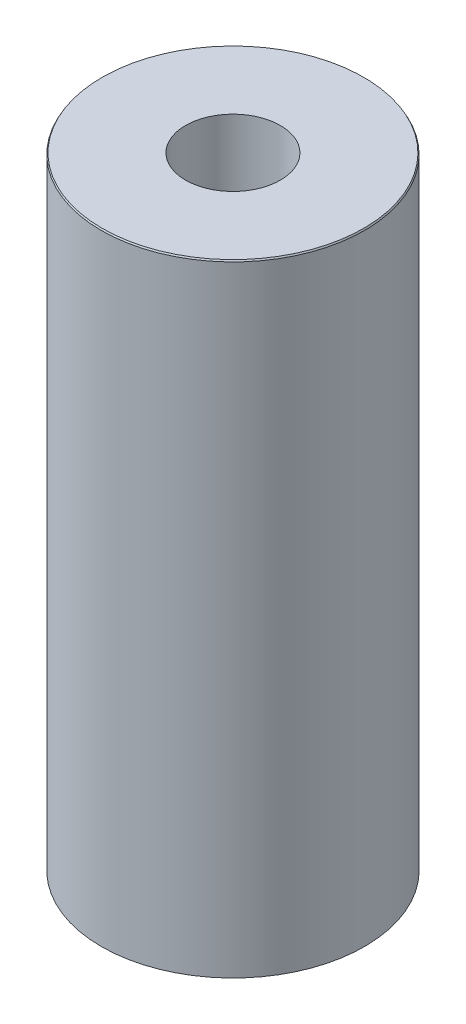
ISO-10303-21;
HEADER;
FILE_DESCRIPTION(('STEP AP214'),'2;1');
FILE_NAME('part.step','',(''),(''),'','','');
FILE_SCHEMA(('AUTOMOTIVE_DESIGN { 1 0 10303 214 1 1 1 1 }'));
ENDSEC;
DATA;
#1=APPLICATION_CONTEXT('core data for automotive mechanical design processes');
#2=APPLICATION_PROTOCOL_DEFINITION('international standard','automotive_design',2000,#1);
#3=PRODUCT_CONTEXT('',#1,'mechanical');
#4=PRODUCT('Part','Part','',(#3));
#5=PRODUCT_RELATED_PRODUCT_CATEGORY('part','',(#4));
#6=PRODUCT_DEFINITION_FORMATION('','',#4);
#7=PRODUCT_DEFINITION_CONTEXT('part definition',#1,'design');
#8=PRODUCT_DEFINITION('design','',#6,#7);
#9=PRODUCT_DEFINITION_SHAPE('','',#8);
#10=(LENGTH_UNIT() NAMED_UNIT(*) SI_UNIT(.MILLI.,.METRE.));
#11=(NAMED_UNIT(*) PLANE_ANGLE_UNIT() SI_UNIT($,.RADIAN.));
#12=(NAMED_UNIT(*) SI_UNIT($,.STERADIAN.) SOLID_ANGLE_UNIT());
#13=UNCERTAINTY_MEASURE_WITH_UNIT(LENGTH_MEASURE(1.E-05),#10,'distance_accuracy_value','');
#14=(GEOMETRIC_REPRESENTATION_CONTEXT(3) GLOBAL_UNCERTAINTY_ASSIGNED_CONTEXT((#13)) GLOBAL_UNIT_ASSIGNED_CONTEXT((#10,
#11,#12)) REPRESENTATION_CONTEXT('',''));
#15=CARTESIAN_POINT('',(0.,0.,0.));
#16=DIRECTION('',(0.,0.,1.));
#17=DIRECTION('',(1.,0.,0.));
#18=AXIS2_PLACEMENT_3D('',#15,#16,#17);
#19=CARTESIAN_POINT('',(0.,224.591932747246,0.));
#20=DIRECTION('',(0.,-1.,0.));
#21=DIRECTION('',(0.,0.,-1.));
#22=AXIS2_PLACEMENT_3D('',#19,#20,#21);
#23=CYLINDRICAL_SURFACE('',#22,47.5);
#24=CARTESIAN_POINT('',(0.,224.07568182986,0.));
#25=DIRECTION('',(0.,1.,0.));
#26=DIRECTION('',(0.,0.,1.));
#27=AXIS2_PLACEMENT_3D('',#24,#25,#26);
#28=CIRCLE('',#27,47.5);
#29=CARTESIAN_POINT('',(0.,224.07568182986,47.5));
#30=VERTEX_POINT('',#29);
#31=EDGE_CURVE('E50',#30,#30,#28,.F.);
#32=ORIENTED_EDGE('',*,*,#31,.T.);
#33=EDGE_LOOP('',(#32));
#34=FACE_BOUND('',#33,.T.);
#35=CARTESIAN_POINT('',(0.,0.298057606122282,0.));
#36=DIRECTION('',(0.,1.,0.));
#37=DIRECTION('',(0.,0.,1.));
#38=AXIS2_PLACEMENT_3D('',#35,#36,#37);
#39=CIRCLE('',#38,47.5);
#40=CARTESIAN_POINT('',(0.,0.298057606122282,47.5));
#41=VERTEX_POINT('',#40);
#42=EDGE_CURVE('E51',#41,#41,#39,.T.);
#43=ORIENTED_EDGE('',*,*,#42,.T.);
#44=EDGE_LOOP('',(#43));
#45=FACE_BOUND('',#44,.T.);
#46=ADVANCED_FACE('F39',(#34,#45),#23,.T.);
#47=CARTESIAN_POINT('',(0.,224.591932747246,0.));
#48=DIRECTION('',(0.,1.,0.));
#49=DIRECTION('',(0.,0.,1.));
#50=AXIS2_PLACEMENT_3D('',#47,#48,#49);
#51=PLANE('',#50);
#52=CARTESIAN_POINT('',(0.,224.591932747246,0.));
#53=DIRECTION('',(0.,1.,0.));
#54=DIRECTION('',(0.,0.,1.));
#55=AXIS2_PLACEMENT_3D('',#52,#53,#54);
#56=CIRCLE('',#55,47.2019423938778);
#57=CARTESIAN_POINT('',(0.,224.591932747246,47.2019423938778));
#58=VERTEX_POINT('',#57);
#59=EDGE_CURVE('E54',#58,#58,#56,.T.);
#60=ORIENTED_EDGE('',*,*,#59,.T.);
#61=EDGE_LOOP('',(#60));
#62=FACE_BOUND('',#61,.T.);
#63=CARTESIAN_POINT('',(0.,224.591932747246,0.));
#64=DIRECTION('',(0.,1.,0.));
#65=DIRECTION('',(0.,0.,1.));
#66=AXIS2_PLACEMENT_3D('',#63,#64,#65);
#67=CIRCLE('',#66,17.1057148038499);
#68=CARTESIAN_POINT('',(0.,224.591932747246,17.1057148038499));
#69=VERTEX_POINT('',#68);
#70=EDGE_CURVE('E58',#69,#69,#67,.T.);
#71=ORIENTED_EDGE('',*,*,#70,.F.);
#72=EDGE_LOOP('',(#71));
#73=FACE_BOUND('',#72,.T.);
#74=ADVANCED_FACE('F69',(#62,#73),#51,.T.);
#75=CARTESIAN_POINT('',(0.,0.,0.));
#76=DIRECTION('',(0.,1.,0.));
#77=DIRECTION('',(0.,0.,1.));
#78=AXIS2_PLACEMENT_3D('',#75,#76,#77);
#79=PLANE('',#78);
#80=CARTESIAN_POINT('',(0.,0.,0.));
#81=DIRECTION('',(0.,1.,0.));
#82=DIRECTION('',(0.,0.,1.));
#83=AXIS2_PLACEMENT_3D('',#80,#81,#82);
#84=CIRCLE('',#83,46.9837490826139);
#85=CARTESIAN_POINT('',(0.,0.,46.9837490826139));
#86=VERTEX_POINT('',#85);
#87=EDGE_CURVE('E10',#86,#86,#84,.F.);
#88=ORIENTED_EDGE('',*,*,#87,.T.);
#89=EDGE_LOOP('',(#88));
#90=FACE_BOUND('',#89,.T.);
#91=CARTESIAN_POINT('',(0.,0.,0.));
#92=DIRECTION('',(0.,1.,0.));
#93=DIRECTION('',(0.,0.,1.));
#94=AXIS2_PLACEMENT_3D('',#91,#92,#93);
#95=CIRCLE('',#94,17.1057148038499);
#96=CARTESIAN_POINT('',(0.,0.,17.1057148038499));
#97=VERTEX_POINT('',#96);
#98=EDGE_CURVE('E63',#97,#97,#95,.T.);
#99=ORIENTED_EDGE('',*,*,#98,.T.);
#100=EDGE_LOOP('',(#99));
#101=FACE_BOUND('',#100,.T.);
#102=ADVANCED_FACE('F75',(#90,#101),#79,.F.);
#103=CARTESIAN_POINT('',(0.,224.591932747246,0.));
#104=DIRECTION('',(0.,-1.,0.));
#105=DIRECTION('',(0.,0.,-1.));
#106=AXIS2_PLACEMENT_3D('',#103,#104,#105);
#107=CYLINDRICAL_SURFACE('',#106,17.1057148038499);
#108=ORIENTED_EDGE('',*,*,#70,.T.);
#109=EDGE_LOOP('',(#108));
#110=FACE_BOUND('',#109,.T.);
#111=ORIENTED_EDGE('',*,*,#98,.F.);
#112=EDGE_LOOP('',(#111));
#113=FACE_BOUND('',#112,.T.);
#114=ADVANCED_FACE('F70',(#110,#113),#107,.F.);
#115=CARTESIAN_POINT('',(0.,224.591932747246,0.));
#116=DIRECTION('',(0.,-1.,0.));
#117=DIRECTION('',(0.,0.,-1.));
#118=AXIS2_PLACEMENT_3D('',#115,#116,#117);
#119=CONICAL_SURFACE('',#118,47.2019423938778,0.523598775598256);
#120=ORIENTED_EDGE('',*,*,#31,.F.);
#121=EDGE_LOOP('',(#120));
#122=FACE_BOUND('',#121,.T.);
#123=ORIENTED_EDGE('',*,*,#59,.F.);
#124=EDGE_LOOP('',(#123));
#125=FACE_BOUND('',#124,.T.);
#126=ADVANCED_FACE('F81',(#122,#125),#119,.T.);
#127=CARTESIAN_POINT('',(0.,0.298057606122282,0.));
#128=DIRECTION('',(0.,1.,0.));
#129=DIRECTION('',(0.,0.,1.));
#130=AXIS2_PLACEMENT_3D('',#127,#128,#129);
#131=CONICAL_SURFACE('',#130,47.5,1.04719755119661);
#132=ORIENTED_EDGE('',*,*,#87,.F.);
#133=EDGE_LOOP('',(#132));
#134=FACE_BOUND('',#133,.T.);
#135=ORIENTED_EDGE('',*,*,#42,.F.);
#136=EDGE_LOOP('',(#135));
#137=FACE_BOUND('',#136,.T.);
#138=ADVANCED_FACE('F45',(#134,#137),#131,.T.);
#139=CLOSED_SHELL('',(#46,#74,#102,#114,#126,#138));
#140=MANIFOLD_SOLID_BREP('B2',#139);
#141=ADVANCED_BREP_SHAPE_REPRESENTATION('',(#18,#140),#14);
#142=SHAPE_DEFINITION_REPRESENTATION(#9,#141);
ENDSEC;
END-ISO-10303-21;
